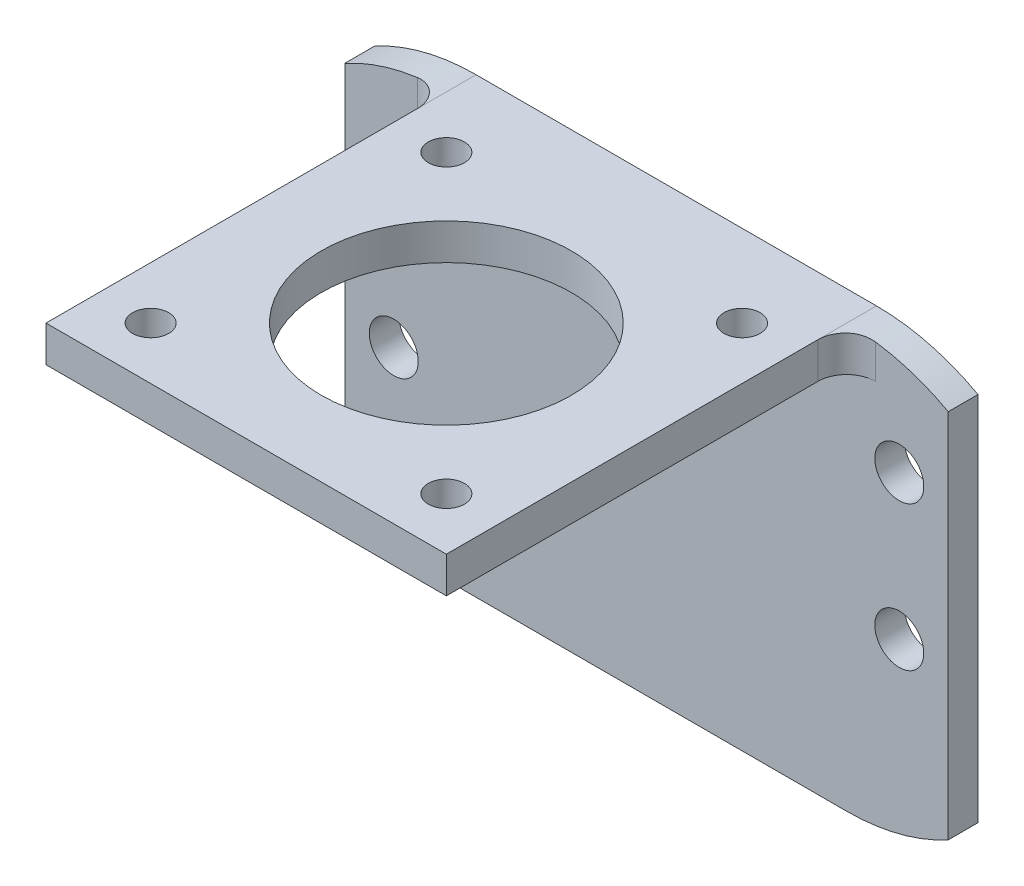
ISO-10303-21;
HEADER;
FILE_DESCRIPTION(('STEP AP214'),'2;1');
FILE_NAME('part.step','',(''),(''),'','','');
FILE_SCHEMA(('AUTOMOTIVE_DESIGN { 1 0 10303 214 1 1 1 1 }'));
ENDSEC;
DATA;
#1=APPLICATION_CONTEXT('core data for automotive mechanical design processes');
#2=APPLICATION_PROTOCOL_DEFINITION('international standard','automotive_design',2000,#1);
#3=PRODUCT_CONTEXT('',#1,'mechanical');
#4=PRODUCT('Part','Part','',(#3));
#5=PRODUCT_RELATED_PRODUCT_CATEGORY('part','',(#4));
#6=PRODUCT_DEFINITION_FORMATION('','',#4);
#7=PRODUCT_DEFINITION_CONTEXT('part definition',#1,'design');
#8=PRODUCT_DEFINITION('design','',#6,#7);
#9=PRODUCT_DEFINITION_SHAPE('','',#8);
#10=(LENGTH_UNIT() NAMED_UNIT(*) SI_UNIT(.MILLI.,.METRE.));
#11=(NAMED_UNIT(*) PLANE_ANGLE_UNIT() SI_UNIT($,.RADIAN.));
#12=(NAMED_UNIT(*) SI_UNIT($,.STERADIAN.) SOLID_ANGLE_UNIT());
#13=UNCERTAINTY_MEASURE_WITH_UNIT(LENGTH_MEASURE(1.E-05),#10,'distance_accuracy_value','');
#14=(GEOMETRIC_REPRESENTATION_CONTEXT(3) GLOBAL_UNCERTAINTY_ASSIGNED_CONTEXT((#13)) GLOBAL_UNIT_ASSIGNED_CONTEXT((#10,
#11,#12)) REPRESENTATION_CONTEXT('',''));
#15=CARTESIAN_POINT('',(0.,0.,0.));
#16=DIRECTION('',(0.,0.,1.));
#17=DIRECTION('',(1.,0.,0.));
#18=AXIS2_PLACEMENT_3D('',#15,#16,#17);
#19=CARTESIAN_POINT('',(-17.6,-34.000000072,-17.6));
#20=DIRECTION('',(0.,0.,1.));
#21=DIRECTION('',(1.,0.,0.));
#22=AXIS2_PLACEMENT_3D('',#19,#20,#21);
#23=PLANE('',#22);
#24=CARTESIAN_POINT('',(22.2228,-18.587500036,-17.6));
#25=DIRECTION('',(0.,0.,-1.));
#26=DIRECTION('',(-1.,0.,0.));
#27=AXIS2_PLACEMENT_3D('',#24,#25,#26);
#28=CIRCLE('',#27,2.15265);
#29=CARTESIAN_POINT('',(20.07015,-18.587500036,-17.6));
#30=VERTEX_POINT('',#29);
#31=EDGE_CURVE('E414',#30,#30,#28,.T.);
#32=ORIENTED_EDGE('',*,*,#31,.T.);
#33=EDGE_LOOP('',(#32));
#34=FACE_BOUND('',#33,.T.);
#35=CARTESIAN_POINT('',(22.2228,-5.887500036,-17.6));
#36=DIRECTION('',(0.,0.,-1.));
#37=DIRECTION('',(-1.,0.,0.));
#38=AXIS2_PLACEMENT_3D('',#35,#36,#37);
#39=CIRCLE('',#38,2.15265);
#40=CARTESIAN_POINT('',(20.07015,-5.887500036,-17.6));
#41=VERTEX_POINT('',#40);
#42=EDGE_CURVE('E395',#41,#41,#39,.T.);
#43=ORIENTED_EDGE('',*,*,#42,.T.);
#44=EDGE_LOOP('',(#43));
#45=FACE_BOUND('',#44,.T.);
#46=CARTESIAN_POINT('',(-22.2228,-18.587500036,-17.6));
#47=DIRECTION('',(0.,0.,1.));
#48=DIRECTION('',(1.,0.,0.));
#49=AXIS2_PLACEMENT_3D('',#46,#47,#48);
#50=CIRCLE('',#49,2.15265);
#51=CARTESIAN_POINT('',(-20.07015,-18.587500036,-17.6));
#52=VERTEX_POINT('',#51);
#53=EDGE_CURVE('E430',#52,#52,#50,.T.);
#54=ORIENTED_EDGE('',*,*,#53,.F.);
#55=EDGE_LOOP('',(#54));
#56=FACE_BOUND('',#55,.T.);
#57=CARTESIAN_POINT('',(-22.2228,-5.887500036,-17.6));
#58=DIRECTION('',(0.,0.,1.));
#59=DIRECTION('',(1.,0.,0.));
#60=AXIS2_PLACEMENT_3D('',#57,#58,#59);
#61=CIRCLE('',#60,2.15265);
#62=CARTESIAN_POINT('',(-20.07015,-5.887500036,-17.6));
#63=VERTEX_POINT('',#62);
#64=EDGE_CURVE('E423',#63,#63,#61,.T.);
#65=ORIENTED_EDGE('',*,*,#64,.F.);
#66=EDGE_LOOP('',(#65));
#67=FACE_BOUND('',#66,.T.);
#68=CARTESIAN_POINT('',(17.6,-15.412500036,-17.6));
#69=DIRECTION('',(0.,0.,-1.));
#70=DIRECTION('',(-1.,0.,0.));
#71=AXIS2_PLACEMENT_3D('',#68,#69,#70);
#72=CIRCLE('',#71,18.587500036);
#73=CARTESIAN_POINT('',(26.5281000000002,-31.7153889817758,-17.6));
#74=VERTEX_POINT('',#73);
#75=CARTESIAN_POINT('',(17.6,-34.000000072,-17.6));
#76=VERTEX_POINT('',#75);
#77=EDGE_CURVE('E164',#74,#76,#72,.T.);
#78=ORIENTED_EDGE('',*,*,#77,.F.);
#79=DIRECTION('',(0.,1.,0.));
#80=VECTOR('',#79,1.);
#81=CARTESIAN_POINT('',(26.5281000000002,-72.739111493604,-17.6));
#82=LINE('',#81,#80);
#83=CARTESIAN_POINT('',(26.5281000000002,0.890388909775759,-17.6));
#84=VERTEX_POINT('',#83);
#85=EDGE_CURVE('E55',#74,#84,#82,.T.);
#86=ORIENTED_EDGE('',*,*,#85,.T.);
#87=CARTESIAN_POINT('',(20.14,3.00063542725829,-17.6));
#88=VERTEX_POINT('',#87);
#89=EDGE_CURVE('E158',#88,#84,#72,.T.);
#90=ORIENTED_EDGE('',*,*,#89,.F.);
#91=DIRECTION('',(0.,1.,0.));
#92=VECTOR('',#91,1.);
#93=CARTESIAN_POINT('',(20.14,-34.000000072,-17.6));
#94=LINE('',#93,#92);
#95=CARTESIAN_POINT('',(20.14,0.,-17.6));
#96=VERTEX_POINT('',#95);
#97=EDGE_CURVE('E269',#88,#96,#94,.F.);
#98=ORIENTED_EDGE('',*,*,#97,.T.);
#99=DIRECTION('',(-1.,0.,0.));
#100=VECTOR('',#99,1.);
#101=CARTESIAN_POINT('',(-17.6,0.,-17.6));
#102=LINE('',#101,#100);
#103=CARTESIAN_POINT('',(-20.14,0.,-17.6));
#104=VERTEX_POINT('',#103);
#105=EDGE_CURVE('E254',#96,#104,#102,.T.);
#106=ORIENTED_EDGE('',*,*,#105,.T.);
#107=DIRECTION('',(0.,1.,0.));
#108=VECTOR('',#107,1.);
#109=CARTESIAN_POINT('',(-20.14,-34.000000072,-17.6));
#110=LINE('',#109,#108);
#111=CARTESIAN_POINT('',(-20.14,3.00063542725829,-17.6));
#112=VERTEX_POINT('',#111);
#113=EDGE_CURVE('E273',#104,#112,#110,.T.);
#114=ORIENTED_EDGE('',*,*,#113,.T.);
#115=CARTESIAN_POINT('',(-17.6,-15.412500036,-17.6));
#116=DIRECTION('',(0.,0.,1.));
#117=DIRECTION('',(1.,0.,0.));
#118=AXIS2_PLACEMENT_3D('',#115,#116,#117);
#119=CIRCLE('',#118,18.587500036);
#120=CARTESIAN_POINT('',(-26.5281000000002,0.890388909775761,-17.6));
#121=VERTEX_POINT('',#120);
#122=EDGE_CURVE('E172',#112,#121,#119,.T.);
#123=ORIENTED_EDGE('',*,*,#122,.T.);
#124=DIRECTION('',(0.,1.,0.));
#125=VECTOR('',#124,1.);
#126=CARTESIAN_POINT('',(-26.5281000000002,-72.739111493604,-17.6));
#127=LINE('',#126,#125);
#128=CARTESIAN_POINT('',(-26.5281000000002,-31.7153889817758,-17.6));
#129=VERTEX_POINT('',#128);
#130=EDGE_CURVE('E151',#129,#121,#127,.T.);
#131=ORIENTED_EDGE('',*,*,#130,.F.);
#132=CARTESIAN_POINT('',(-17.6,-34.000000072,-17.6));
#133=VERTEX_POINT('',#132);
#134=EDGE_CURVE('E162',#129,#133,#119,.T.);
#135=ORIENTED_EDGE('',*,*,#134,.T.);
#136=DIRECTION('',(1.,0.,0.));
#137=VECTOR('',#136,1.);
#138=CARTESIAN_POINT('',(-17.6,-34.000000072,-17.6));
#139=LINE('',#138,#137);
#140=EDGE_CURVE('E182',#133,#76,#139,.T.);
#141=ORIENTED_EDGE('',*,*,#140,.T.);
#142=EDGE_LOOP('',(#78,#86,#90,#98,#106,#114,#123,#131,#135,#141));
#143=FACE_BOUND('',#142,.T.);
#144=ADVANCED_FACE('F39',(#34,#45,#56,#67,#143),#23,.T.);
#145=CARTESIAN_POINT('',(-17.6,-34.000000072,-20.2162));
#146=DIRECTION('',(0.,0.,-1.));
#147=DIRECTION('',(-1.,0.,0.));
#148=AXIS2_PLACEMENT_3D('',#145,#146,#147);
#149=PLANE('',#148);
#150=CARTESIAN_POINT('',(22.2228,-18.587500036,-20.2162));
#151=DIRECTION('',(0.,0.,-1.));
#152=DIRECTION('',(-1.,0.,0.));
#153=AXIS2_PLACEMENT_3D('',#150,#151,#152);
#154=CIRCLE('',#153,2.15265);
#155=CARTESIAN_POINT('',(20.07015,-18.587500036,-20.2162));
#156=VERTEX_POINT('',#155);
#157=EDGE_CURVE('E418',#156,#156,#154,.T.);
#158=ORIENTED_EDGE('',*,*,#157,.F.);
#159=EDGE_LOOP('',(#158));
#160=FACE_BOUND('',#159,.T.);
#161=CARTESIAN_POINT('',(22.2228,-5.887500036,-20.2162));
#162=DIRECTION('',(0.,0.,-1.));
#163=DIRECTION('',(-1.,0.,0.));
#164=AXIS2_PLACEMENT_3D('',#161,#162,#163);
#165=CIRCLE('',#164,2.15265);
#166=CARTESIAN_POINT('',(20.07015,-5.887500036,-20.2162));
#167=VERTEX_POINT('',#166);
#168=EDGE_CURVE('E419',#167,#167,#165,.T.);
#169=ORIENTED_EDGE('',*,*,#168,.F.);
#170=EDGE_LOOP('',(#169));
#171=FACE_BOUND('',#170,.T.);
#172=CARTESIAN_POINT('',(-22.2228,-18.587500036,-20.2162));
#173=DIRECTION('',(0.,0.,-1.));
#174=DIRECTION('',(-1.,0.,0.));
#175=AXIS2_PLACEMENT_3D('',#172,#173,#174);
#176=CIRCLE('',#175,2.15265);
#177=CARTESIAN_POINT('',(-24.37545,-18.587500036,-20.2162));
#178=VERTEX_POINT('',#177);
#179=EDGE_CURVE('E171',#178,#178,#176,.F.);
#180=ORIENTED_EDGE('',*,*,#179,.T.);
#181=EDGE_LOOP('',(#180));
#182=FACE_BOUND('',#181,.T.);
#183=CARTESIAN_POINT('',(-22.2228,-5.887500036,-20.2162));
#184=DIRECTION('',(0.,0.,-1.));
#185=DIRECTION('',(-1.,0.,0.));
#186=AXIS2_PLACEMENT_3D('',#183,#184,#185);
#187=CIRCLE('',#186,2.15265);
#188=CARTESIAN_POINT('',(-24.37545,-5.887500036,-20.2162));
#189=VERTEX_POINT('',#188);
#190=EDGE_CURVE('E434',#189,#189,#187,.F.);
#191=ORIENTED_EDGE('',*,*,#190,.T.);
#192=EDGE_LOOP('',(#191));
#193=FACE_BOUND('',#192,.T.);
#194=CARTESIAN_POINT('',(17.6,-15.412500036,-20.2162));
#195=DIRECTION('',(0.,0.,-1.));
#196=DIRECTION('',(-1.,0.,0.));
#197=AXIS2_PLACEMENT_3D('',#194,#195,#196);
#198=CIRCLE('',#197,18.587500036);
#199=CARTESIAN_POINT('',(17.6,3.175,-20.2162));
#200=VERTEX_POINT('',#199);
#201=CARTESIAN_POINT('',(26.5281000000002,0.890388909775759,-20.2162));
#202=VERTEX_POINT('',#201);
#203=EDGE_CURVE('E149',#200,#202,#198,.T.);
#204=ORIENTED_EDGE('',*,*,#203,.T.);
#205=DIRECTION('',(0.,1.,0.));
#206=VECTOR('',#205,1.);
#207=CARTESIAN_POINT('',(26.5281000000002,-72.739111493604,-20.2162));
#208=LINE('',#207,#206);
#209=CARTESIAN_POINT('',(26.5281000000002,-31.7153889817758,-20.2162));
#210=VERTEX_POINT('',#209);
#211=EDGE_CURVE('E134',#210,#202,#208,.T.);
#212=ORIENTED_EDGE('',*,*,#211,.F.);
#213=CARTESIAN_POINT('',(17.6,-34.000000072,-20.2162));
#214=VERTEX_POINT('',#213);
#215=EDGE_CURVE('E145',#210,#214,#198,.T.);
#216=ORIENTED_EDGE('',*,*,#215,.T.);
#217=DIRECTION('',(-1.,0.,0.));
#218=VECTOR('',#217,1.);
#219=CARTESIAN_POINT('',(-17.6,-34.000000072,-20.2162));
#220=LINE('',#219,#218);
#221=CARTESIAN_POINT('',(-17.6,-34.000000072,-20.2162));
#222=VERTEX_POINT('',#221);
#223=EDGE_CURVE('E188',#214,#222,#220,.T.);
#224=ORIENTED_EDGE('',*,*,#223,.T.);
#225=CARTESIAN_POINT('',(-17.6,-15.412500036,-20.2162));
#226=DIRECTION('',(0.,0.,-1.));
#227=DIRECTION('',(-1.,0.,0.));
#228=AXIS2_PLACEMENT_3D('',#225,#226,#227);
#229=CIRCLE('',#228,18.587500036);
#230=CARTESIAN_POINT('',(-26.5281000000002,-31.7153889817758,-20.2162));
#231=VERTEX_POINT('',#230);
#232=EDGE_CURVE('E176',#231,#222,#229,.F.);
#233=ORIENTED_EDGE('',*,*,#232,.F.);
#234=DIRECTION('',(0.,1.,0.));
#235=VECTOR('',#234,1.);
#236=CARTESIAN_POINT('',(-26.5281000000002,-72.739111493604,-20.2162));
#237=LINE('',#236,#235);
#238=CARTESIAN_POINT('',(-26.5281000000002,0.890388909775761,-20.2162));
#239=VERTEX_POINT('',#238);
#240=EDGE_CURVE('E63',#231,#239,#237,.T.);
#241=ORIENTED_EDGE('',*,*,#240,.T.);
#242=CARTESIAN_POINT('',(-17.6,3.175,-20.2162));
#243=VERTEX_POINT('',#242);
#244=EDGE_CURVE('E177',#243,#239,#229,.F.);
#245=ORIENTED_EDGE('',*,*,#244,.F.);
#246=DIRECTION('',(-1.,0.,0.));
#247=VECTOR('',#246,1.);
#248=CARTESIAN_POINT('',(-17.6,3.175,-20.2162));
#249=LINE('',#248,#247);
#250=EDGE_CURVE('E181',#200,#243,#249,.T.);
#251=ORIENTED_EDGE('',*,*,#250,.F.);
#252=EDGE_LOOP('',(#204,#212,#216,#224,#233,#241,#245,#251));
#253=FACE_BOUND('',#252,.T.);
#254=ADVANCED_FACE('F143',(#160,#171,#182,#193,#253),#149,.T.);
#255=CARTESIAN_POINT('',(17.6,-15.412500036,-61.7791136122758));
#256=DIRECTION('',(0.,0.,1.));
#257=DIRECTION('',(1.,0.,0.));
#258=AXIS2_PLACEMENT_3D('',#255,#256,#257);
#259=CYLINDRICAL_SURFACE('',#258,18.587500036);
#260=DIRECTION('',(0.,0.,1.));
#261=VECTOR('',#260,1.);
#262=CARTESIAN_POINT('',(26.5281000000002,0.890388909775759,-61.7791136122758));
#263=LINE('',#262,#261);
#264=EDGE_CURVE('E11',#202,#84,#263,.T.);
#265=ORIENTED_EDGE('',*,*,#264,.F.);
#266=ORIENTED_EDGE('',*,*,#203,.F.);
#267=DIRECTION('',(0.,0.,1.));
#268=VECTOR('',#267,1.);
#269=CARTESIAN_POINT('',(17.6,3.175,-61.7791136122758));
#270=LINE('',#269,#268);
#271=CARTESIAN_POINT('',(17.6,3.175,-15.06));
#272=VERTEX_POINT('',#271);
#273=EDGE_CURVE('E168',#200,#272,#270,.T.);
#274=ORIENTED_EDGE('',*,*,#273,.T.);
#275=CARTESIAN_POINT('',(17.6,3.175,-15.06));
#276=CARTESIAN_POINT('',(17.5999931612362,3.17499693402641,-15.1314284172821));
#277=CARTESIAN_POINT('',(17.6030129793054,3.17499991997307,-15.2028535891198));
#278=CARTESIAN_POINT('',(17.6150530030966,3.17499569036358,-15.3451931400053));
#279=CARTESIAN_POINT('',(17.6240729257152,3.17498847528872,-15.4161075429933));
#280=CARTESIAN_POINT('',(17.6480515684337,3.17494155918318,-15.5568771701242));
#281=CARTESIAN_POINT('',(17.6630059890529,3.17490188164914,-15.6267331231476));
#282=CARTESIAN_POINT('',(17.698732316112,3.17474627704112,-15.7649200925291));
#283=CARTESIAN_POINT('',(17.7195041514546,3.17463035089897,-15.8332511275129));
#284=CARTESIAN_POINT('',(17.790378480981,3.17408607437965,-16.0352990115704));
#285=CARTESIAN_POINT('',(17.8490493592747,3.1734612891385,-16.1661264688547));
#286=CARTESIAN_POINT('',(17.9874767653926,3.17108887635561,-16.4159742418495));
#287=CARTESIAN_POINT('',(18.0672296398086,3.16934144328832,-16.5349965984169));
#288=CARTESIAN_POINT('',(18.2454940723609,3.16400177839637,-16.7578757419865));
#289=CARTESIAN_POINT('',(18.3439907594898,3.16041100523662,-16.8617444369928));
#290=CARTESIAN_POINT('',(18.5569498439056,3.15065537320439,-17.0514544234255));
#291=CARTESIAN_POINT('',(18.671414111685,3.1444902125912,-17.1372935998615));
#292=CARTESIAN_POINT('',(18.9125648468889,3.12899047816642,-17.288269162323));
#293=CARTESIAN_POINT('',(19.0392124257262,3.11966576391962,-17.3534687457287));
#294=CARTESIAN_POINT('',(19.3013252301638,3.09744066044685,-17.4617294221921));
#295=CARTESIAN_POINT('',(19.4367863982222,3.08454190782432,-17.5048006224497));
#296=CARTESIAN_POINT('',(19.6675262789357,3.05989129153794,-17.5574927622084));
#297=CARTESIAN_POINT('',(19.7615190081297,3.04913473893987,-17.573439843806));
#298=CARTESIAN_POINT('',(19.9503650862469,3.02604854916415,-17.5946929096138));
#299=CARTESIAN_POINT('',(20.0452169377388,3.01372128881368,-17.6000147733838));
#300=CARTESIAN_POINT('',(20.14,3.0006354272583,-17.6));
#301=B_SPLINE_CURVE_WITH_KNOTS('',3,(#275,#276,#277,#278,#279,#280,#281,#282,#283,#284,#285,
#286,#287,#288,#289,#290,#291,#292,#293,#294,#295,#296,#297,#298,#299,#300),.UNSPECIFIED.,.F.,
.F.,(4,2,2,2,2,2,2,2,2,2,2,2,4),(0.,0.21421558472874,0.42842106281944,0.642471633810544,
0.856519588907374,1.28444771401514,1.71230172980808,2.13981769847853,2.56738378983021,
2.99362774053708,3.41967682967415,3.706929625535,3.99375279512196),.UNSPECIFIED.);
#302=EDGE_CURVE('E369',#272,#88,#301,.T.);
#303=ORIENTED_EDGE('',*,*,#302,.T.);
#304=ORIENTED_EDGE('',*,*,#89,.T.);
#305=EDGE_LOOP('',(#265,#266,#274,#303,#304));
#306=FACE_BOUND('',#305,.T.);
#307=ADVANCED_FACE('F306',(#306),#259,.T.);
#308=DIRECTION('',(0.,0.,1.));
#309=VECTOR('',#308,1.);
#310=CARTESIAN_POINT('',(26.5281000000002,-31.7153889817758,-61.7791136122758));
#311=LINE('',#310,#309);
#312=EDGE_CURVE('E49',#74,#210,#311,.F.);
#313=ORIENTED_EDGE('',*,*,#312,.F.);
#314=ORIENTED_EDGE('',*,*,#77,.T.);
#315=DIRECTION('',(0.,0.,-1.));
#316=VECTOR('',#315,1.);
#317=CARTESIAN_POINT('',(17.6,-34.000000072,-17.6));
#318=LINE('',#317,#316);
#319=EDGE_CURVE('E156',#76,#214,#318,.T.);
#320=ORIENTED_EDGE('',*,*,#319,.T.);
#321=ORIENTED_EDGE('',*,*,#215,.F.);
#322=EDGE_LOOP('',(#313,#314,#320,#321));
#323=FACE_BOUND('',#322,.T.);
#324=ADVANCED_FACE('F154',(#323),#259,.T.);
#325=CARTESIAN_POINT('',(-17.6,-15.412500036,-61.7791136122758));
#326=DIRECTION('',(0.,0.,1.));
#327=DIRECTION('',(1.,0.,0.));
#328=AXIS2_PLACEMENT_3D('',#325,#326,#327);
#329=CYLINDRICAL_SURFACE('',#328,18.587500036);
#330=DIRECTION('',(0.,0.,1.));
#331=VECTOR('',#330,1.);
#332=CARTESIAN_POINT('',(-26.5281000000002,0.890388909775759,-61.7791136122758));
#333=LINE('',#332,#331);
#334=EDGE_CURVE('E140',#121,#239,#333,.F.);
#335=ORIENTED_EDGE('',*,*,#334,.F.);
#336=ORIENTED_EDGE('',*,*,#122,.F.);
#337=CARTESIAN_POINT('',(-20.14,3.00063542725829,-17.6));
#338=CARTESIAN_POINT('',(-20.0692924553346,3.01039313748778,-17.6000069827787));
#339=CARTESIAN_POINT('',(-19.9985286608016,3.01973573326216,-17.5970474692984));
#340=CARTESIAN_POINT('',(-19.857385702153,3.03755116012512,-17.5852199448435));
#341=CARTESIAN_POINT('',(-19.7870065428358,3.04602398038619,-17.5763518603256));
#342=CARTESIAN_POINT('',(-19.6471751542577,3.06205510170126,-17.5527390160558));
#343=CARTESIAN_POINT('',(-19.5777223770742,3.06961396680143,-17.5379979052133));
#344=CARTESIAN_POINT('',(-19.4402260368855,3.08381075540795,-17.502736368623));
#345=CARTESIAN_POINT('',(-19.372182429582,3.09044870790145,-17.482216124844));
#346=CARTESIAN_POINT('',(-19.1707978248236,3.10899687783809,-17.4121078935766));
#347=CARTESIAN_POINT('',(-19.0401888499217,3.1195430126498,-17.3539700057755));
#348=CARTESIAN_POINT('',(-18.7904916584162,3.13726041150881,-17.2165618740493));
#349=CARTESIAN_POINT('',(-18.6714003227553,3.14443259129124,-17.1372973733211));
#350=CARTESIAN_POINT('',(-18.4486411511082,3.15595044978954,-16.960272575627));
#351=CARTESIAN_POINT('',(-18.3449010064251,3.1603097274703,-16.8626042611015));
#352=CARTESIAN_POINT('',(-18.1551372943591,3.16695164969358,-16.651256306842));
#353=CARTESIAN_POINT('',(-18.0691178431168,3.1692338121862,-16.537572957458));
#354=CARTESIAN_POINT('',(-17.9170951586384,3.17245146158456,-16.2971633734574));
#355=CARTESIAN_POINT('',(-17.8511377634112,3.17338388257364,-16.1704081431069));
#356=CARTESIAN_POINT('',(-17.7413962589898,3.17454365914328,-15.9076681406179));
#357=CARTESIAN_POINT('',(-17.6976001795651,3.17477139569342,-15.7716883961275));
#358=CARTESIAN_POINT('',(-17.6437352753496,3.17496134322605,-15.5391425867541));
#359=CARTESIAN_POINT('',(-17.6273464137258,3.17498545833033,-15.4439913462555));
#360=CARTESIAN_POINT('',(-17.6054787825033,3.17500005264803,-15.2525730274839));
#361=CARTESIAN_POINT('',(-17.5999854130414,3.17499057692041,-15.1563076165195));
#362=CARTESIAN_POINT('',(-17.6,3.175,-15.06));
#363=B_SPLINE_CURVE_WITH_KNOTS('',3,(#337,#338,#339,#340,#341,#342,#343,#344,#345,#346,#347,
#348,#349,#350,#351,#352,#353,#354,#355,#356,#357,#358,#359,#360,#361,#362),.UNSPECIFIED.,.F.,
.F.,(4,2,2,2,2,2,2,2,2,2,2,2,4),(0.,0.214067809753982,0.428138284030593,0.642075963281206,
0.856006906983349,1.28382588921631,1.71152868874404,2.13714795400253,2.56286597037902,
2.98954948929682,3.41600229236707,3.70507439784128,3.99375888684438),.UNSPECIFIED.);
#364=CARTESIAN_POINT('',(-17.6,3.175,-15.06));
#365=VERTEX_POINT('',#364);
#366=EDGE_CURVE('E284',#112,#365,#363,.T.);
#367=ORIENTED_EDGE('',*,*,#366,.T.);
#368=DIRECTION('',(0.,0.,1.));
#369=VECTOR('',#368,1.);
#370=CARTESIAN_POINT('',(-17.6,3.175,17.6));
#371=LINE('',#370,#369);
#372=EDGE_CURVE('E244',#243,#365,#371,.T.);
#373=ORIENTED_EDGE('',*,*,#372,.F.);
#374=ORIENTED_EDGE('',*,*,#244,.T.);
#375=EDGE_LOOP('',(#335,#336,#367,#373,#374));
#376=FACE_BOUND('',#375,.T.);
#377=ADVANCED_FACE('F305',(#376),#329,.T.);
#378=CARTESIAN_POINT('',(0.,3.175,0.));
#379=DIRECTION('',(0.,-1.,0.));
#380=DIRECTION('',(0.,0.,-1.));
#381=AXIS2_PLACEMENT_3D('',#378,#379,#380);
#382=PLANE('',#381);
#383=DIRECTION('',(0.,0.,-1.));
#384=VECTOR('',#383,1.);
#385=CARTESIAN_POINT('',(17.6,3.175,17.6));
#386=LINE('',#385,#384);
#387=CARTESIAN_POINT('',(17.6,3.175,17.6));
#388=VERTEX_POINT('',#387);
#389=EDGE_CURVE('E238',#388,#272,#386,.T.);
#390=ORIENTED_EDGE('',*,*,#389,.T.);
#391=ORIENTED_EDGE('',*,*,#273,.F.);
#392=ORIENTED_EDGE('',*,*,#250,.T.);
#393=ORIENTED_EDGE('',*,*,#372,.T.);
#394=CARTESIAN_POINT('',(-17.6,3.175,17.6));
#395=VERTEX_POINT('',#394);
#396=EDGE_CURVE('E242',#365,#395,#371,.T.);
#397=ORIENTED_EDGE('',*,*,#396,.T.);
#398=DIRECTION('',(1.,0.,0.));
#399=VECTOR('',#398,1.);
#400=CARTESIAN_POINT('',(-17.6,3.175,17.6));
#401=LINE('',#400,#399);
#402=EDGE_CURVE('E247',#395,#388,#401,.T.);
#403=ORIENTED_EDGE('',*,*,#402,.T.);
#404=EDGE_LOOP('',(#390,#391,#392,#393,#397,#403));
#405=FACE_BOUND('',#404,.T.);
#406=CARTESIAN_POINT('',(13.,3.175,-13.));
#407=DIRECTION('',(0.,1.,0.));
#408=DIRECTION('',(0.,0.,1.));
#409=AXIS2_PLACEMENT_3D('',#406,#407,#408);
#410=CIRCLE('',#409,1.5875);
#411=CARTESIAN_POINT('',(13.,3.175,-11.4125));
#412=VERTEX_POINT('',#411);
#413=EDGE_CURVE('E230',#412,#412,#410,.T.);
#414=ORIENTED_EDGE('',*,*,#413,.F.);
#415=EDGE_LOOP('',(#414));
#416=FACE_BOUND('',#415,.T.);
#417=CARTESIAN_POINT('',(-13.,3.175,-13.));
#418=DIRECTION('',(0.,1.,0.));
#419=DIRECTION('',(0.,0.,-1.));
#420=AXIS2_PLACEMENT_3D('',#417,#418,#419);
#421=CIRCLE('',#420,1.5875);
#422=CARTESIAN_POINT('',(-13.,3.175,-14.5875));
#423=VERTEX_POINT('',#422);
#424=EDGE_CURVE('E222',#423,#423,#421,.T.);
#425=ORIENTED_EDGE('',*,*,#424,.F.);
#426=EDGE_LOOP('',(#425));
#427=FACE_BOUND('',#426,.T.);
#428=CARTESIAN_POINT('',(13.,3.175,13.));
#429=DIRECTION('',(0.,1.,0.));
#430=DIRECTION('',(0.,0.,-1.));
#431=AXIS2_PLACEMENT_3D('',#428,#429,#430);
#432=CIRCLE('',#431,1.5875);
#433=CARTESIAN_POINT('',(13.,3.175,11.4125));
#434=VERTEX_POINT('',#433);
#435=EDGE_CURVE('E214',#434,#434,#432,.T.);
#436=ORIENTED_EDGE('',*,*,#435,.F.);
#437=EDGE_LOOP('',(#436));
#438=FACE_BOUND('',#437,.T.);
#439=CARTESIAN_POINT('',(-13.,3.175,13.));
#440=DIRECTION('',(0.,1.,0.));
#441=DIRECTION('',(0.,0.,1.));
#442=AXIS2_PLACEMENT_3D('',#439,#440,#441);
#443=CIRCLE('',#442,1.5875);
#444=CARTESIAN_POINT('',(-13.,3.175,14.5875));
#445=VERTEX_POINT('',#444);
#446=EDGE_CURVE('E206',#445,#445,#443,.T.);
#447=ORIENTED_EDGE('',*,*,#446,.F.);
#448=EDGE_LOOP('',(#447));
#449=FACE_BOUND('',#448,.T.);
#450=CARTESIAN_POINT('',(0.,3.175,0.));
#451=DIRECTION('',(0.,1.,0.));
#452=DIRECTION('',(0.,0.,1.));
#453=AXIS2_PLACEMENT_3D('',#450,#451,#452);
#454=CIRCLE('',#453,11.);
#455=CARTESIAN_POINT('',(0.,3.175,11.));
#456=VERTEX_POINT('',#455);
#457=EDGE_CURVE('E198',#456,#456,#454,.T.);
#458=ORIENTED_EDGE('',*,*,#457,.F.);
#459=EDGE_LOOP('',(#458));
#460=FACE_BOUND('',#459,.T.);
#461=ADVANCED_FACE('F339',(#405,#416,#427,#438,#449,#460),#382,.F.);
#462=CARTESIAN_POINT('',(0.,0.,0.));
#463=DIRECTION('',(0.,-1.,0.));
#464=DIRECTION('',(0.,0.,-1.));
#465=AXIS2_PLACEMENT_3D('',#462,#463,#464);
#466=PLANE('',#465);
#467=CARTESIAN_POINT('',(-13.,0.,13.));
#468=DIRECTION('',(0.,1.,0.));
#469=DIRECTION('',(0.,0.,1.));
#470=AXIS2_PLACEMENT_3D('',#467,#468,#469);
#471=CIRCLE('',#470,1.5875);
#472=CARTESIAN_POINT('',(-13.,0.,14.5875));
#473=VERTEX_POINT('',#472);
#474=EDGE_CURVE('E202',#473,#473,#471,.T.);
#475=ORIENTED_EDGE('',*,*,#474,.T.);
#476=EDGE_LOOP('',(#475));
#477=FACE_BOUND('',#476,.T.);
#478=CARTESIAN_POINT('',(-13.,0.,-13.));
#479=DIRECTION('',(0.,1.,0.));
#480=DIRECTION('',(0.,0.,-1.));
#481=AXIS2_PLACEMENT_3D('',#478,#479,#480);
#482=CIRCLE('',#481,1.5875);
#483=CARTESIAN_POINT('',(-13.,0.,-14.5875));
#484=VERTEX_POINT('',#483);
#485=EDGE_CURVE('E218',#484,#484,#482,.T.);
#486=ORIENTED_EDGE('',*,*,#485,.T.);
#487=EDGE_LOOP('',(#486));
#488=FACE_BOUND('',#487,.T.);
#489=DIRECTION('',(0.,0.,-1.));
#490=VECTOR('',#489,1.);
#491=CARTESIAN_POINT('',(17.6,0.,17.6));
#492=LINE('',#491,#490);
#493=CARTESIAN_POINT('',(17.6,0.,17.6));
#494=VERTEX_POINT('',#493);
#495=CARTESIAN_POINT('',(17.6,0.,-15.06));
#496=VERTEX_POINT('',#495);
#497=EDGE_CURVE('E234',#494,#496,#492,.T.);
#498=ORIENTED_EDGE('',*,*,#497,.F.);
#499=DIRECTION('',(1.,0.,0.));
#500=VECTOR('',#499,1.);
#501=CARTESIAN_POINT('',(-17.6,0.,17.6));
#502=LINE('',#501,#500);
#503=CARTESIAN_POINT('',(-17.6,0.,17.6));
#504=VERTEX_POINT('',#503);
#505=EDGE_CURVE('E243',#504,#494,#502,.T.);
#506=ORIENTED_EDGE('',*,*,#505,.F.);
#507=DIRECTION('',(0.,0.,1.));
#508=VECTOR('',#507,1.);
#509=CARTESIAN_POINT('',(-17.6,0.,17.6));
#510=LINE('',#509,#508);
#511=CARTESIAN_POINT('',(-17.6,0.,-15.06));
#512=VERTEX_POINT('',#511);
#513=EDGE_CURVE('E257',#512,#504,#510,.T.);
#514=ORIENTED_EDGE('',*,*,#513,.F.);
#515=CARTESIAN_POINT('',(-20.14,0.,-15.06));
#516=DIRECTION('',(0.,-1.,0.));
#517=DIRECTION('',(0.,0.,-1.));
#518=AXIS2_PLACEMENT_3D('',#515,#516,#517);
#519=CIRCLE('',#518,2.54);
#520=EDGE_CURVE('E293',#512,#104,#519,.F.);
#521=ORIENTED_EDGE('',*,*,#520,.T.);
#522=ORIENTED_EDGE('',*,*,#105,.F.);
#523=CARTESIAN_POINT('',(20.14,0.,-15.06));
#524=DIRECTION('',(0.,-1.,0.));
#525=DIRECTION('',(0.,0.,-1.));
#526=AXIS2_PLACEMENT_3D('',#523,#524,#525);
#527=CIRCLE('',#526,2.54);
#528=EDGE_CURVE('E368',#96,#496,#527,.F.);
#529=ORIENTED_EDGE('',*,*,#528,.T.);
#530=EDGE_LOOP('',(#498,#506,#514,#521,#522,#529));
#531=FACE_BOUND('',#530,.T.);
#532=CARTESIAN_POINT('',(13.,0.,-13.));
#533=DIRECTION('',(0.,1.,0.));
#534=DIRECTION('',(0.,0.,1.));
#535=AXIS2_PLACEMENT_3D('',#532,#533,#534);
#536=CIRCLE('',#535,1.5875);
#537=CARTESIAN_POINT('',(13.,0.,-11.4125));
#538=VERTEX_POINT('',#537);
#539=EDGE_CURVE('E226',#538,#538,#536,.T.);
#540=ORIENTED_EDGE('',*,*,#539,.T.);
#541=EDGE_LOOP('',(#540));
#542=FACE_BOUND('',#541,.T.);
#543=CARTESIAN_POINT('',(13.,0.,13.));
#544=DIRECTION('',(0.,1.,0.));
#545=DIRECTION('',(0.,0.,-1.));
#546=AXIS2_PLACEMENT_3D('',#543,#544,#545);
#547=CIRCLE('',#546,1.5875);
#548=CARTESIAN_POINT('',(13.,0.,11.4125));
#549=VERTEX_POINT('',#548);
#550=EDGE_CURVE('E210',#549,#549,#547,.T.);
#551=ORIENTED_EDGE('',*,*,#550,.T.);
#552=EDGE_LOOP('',(#551));
#553=FACE_BOUND('',#552,.T.);
#554=CARTESIAN_POINT('',(0.,0.,0.));
#555=DIRECTION('',(0.,1.,0.));
#556=DIRECTION('',(0.,0.,1.));
#557=AXIS2_PLACEMENT_3D('',#554,#555,#556);
#558=CIRCLE('',#557,11.);
#559=CARTESIAN_POINT('',(0.,0.,11.));
#560=VERTEX_POINT('',#559);
#561=EDGE_CURVE('E195',#560,#560,#558,.T.);
#562=ORIENTED_EDGE('',*,*,#561,.T.);
#563=EDGE_LOOP('',(#562));
#564=FACE_BOUND('',#563,.T.);
#565=ADVANCED_FACE('F342',(#477,#488,#531,#542,#553,#564),#466,.T.);
#566=CARTESIAN_POINT('',(17.6,3.175,17.6));
#567=DIRECTION('',(-1.,0.,0.));
#568=DIRECTION('',(0.,0.,1.));
#569=AXIS2_PLACEMENT_3D('',#566,#567,#568);
#570=PLANE('',#569);
#571=ORIENTED_EDGE('',*,*,#497,.T.);
#572=DIRECTION('',(0.,1.,0.));
#573=VECTOR('',#572,1.);
#574=CARTESIAN_POINT('',(17.6,3.175,-15.06));
#575=LINE('',#574,#573);
#576=EDGE_CURVE('E280',#496,#272,#575,.T.);
#577=ORIENTED_EDGE('',*,*,#576,.T.);
#578=ORIENTED_EDGE('',*,*,#389,.F.);
#579=DIRECTION('',(0.,-1.,0.));
#580=VECTOR('',#579,1.);
#581=CARTESIAN_POINT('',(17.6,3.175,17.6));
#582=LINE('',#581,#580);
#583=EDGE_CURVE('E250',#388,#494,#582,.T.);
#584=ORIENTED_EDGE('',*,*,#583,.T.);
#585=EDGE_LOOP('',(#571,#577,#578,#584));
#586=FACE_BOUND('',#585,.T.);
#587=ADVANCED_FACE('F346',(#586),#570,.F.);
#588=CARTESIAN_POINT('',(-17.6,3.175,17.6));
#589=DIRECTION('',(1.,0.,0.));
#590=DIRECTION('',(0.,0.,-1.));
#591=AXIS2_PLACEMENT_3D('',#588,#589,#590);
#592=PLANE('',#591);
#593=ORIENTED_EDGE('',*,*,#396,.F.);
#594=DIRECTION('',(0.,1.,0.));
#595=VECTOR('',#594,1.);
#596=CARTESIAN_POINT('',(-17.6,3.175,-15.06));
#597=LINE('',#596,#595);
#598=EDGE_CURVE('E277',#365,#512,#597,.F.);
#599=ORIENTED_EDGE('',*,*,#598,.T.);
#600=ORIENTED_EDGE('',*,*,#513,.T.);
#601=DIRECTION('',(0.,-1.,0.));
#602=VECTOR('',#601,1.);
#603=CARTESIAN_POINT('',(-17.6,3.175,17.6));
#604=LINE('',#603,#602);
#605=EDGE_CURVE('E265',#395,#504,#604,.T.);
#606=ORIENTED_EDGE('',*,*,#605,.F.);
#607=EDGE_LOOP('',(#593,#599,#600,#606));
#608=FACE_BOUND('',#607,.T.);
#609=ADVANCED_FACE('F350',(#608),#592,.F.);
#610=CARTESIAN_POINT('',(-17.6,3.175,17.6));
#611=DIRECTION('',(0.,0.,-1.));
#612=DIRECTION('',(-1.,0.,0.));
#613=AXIS2_PLACEMENT_3D('',#610,#611,#612);
#614=PLANE('',#613);
#615=ORIENTED_EDGE('',*,*,#505,.T.);
#616=ORIENTED_EDGE('',*,*,#583,.F.);
#617=ORIENTED_EDGE('',*,*,#402,.F.);
#618=ORIENTED_EDGE('',*,*,#605,.T.);
#619=EDGE_LOOP('',(#615,#616,#617,#618));
#620=FACE_BOUND('',#619,.T.);
#621=ADVANCED_FACE('F337',(#620),#614,.F.);
#622=CARTESIAN_POINT('',(13.,3.175,-13.));
#623=DIRECTION('',(0.,-1.,0.));
#624=DIRECTION('',(0.,0.,-1.));
#625=AXIS2_PLACEMENT_3D('',#622,#623,#624);
#626=CYLINDRICAL_SURFACE('',#625,1.5875);
#627=ORIENTED_EDGE('',*,*,#413,.T.);
#628=EDGE_LOOP('',(#627));
#629=FACE_BOUND('',#628,.T.);
#630=ORIENTED_EDGE('',*,*,#539,.F.);
#631=EDGE_LOOP('',(#630));
#632=FACE_BOUND('',#631,.T.);
#633=ADVANCED_FACE('F333',(#629,#632),#626,.F.);
#634=CARTESIAN_POINT('',(-13.,3.175,-13.));
#635=DIRECTION('',(0.,-1.,0.));
#636=DIRECTION('',(0.,0.,-1.));
#637=AXIS2_PLACEMENT_3D('',#634,#635,#636);
#638=CYLINDRICAL_SURFACE('',#637,1.5875);
#639=ORIENTED_EDGE('',*,*,#424,.T.);
#640=EDGE_LOOP('',(#639));
#641=FACE_BOUND('',#640,.T.);
#642=ORIENTED_EDGE('',*,*,#485,.F.);
#643=EDGE_LOOP('',(#642));
#644=FACE_BOUND('',#643,.T.);
#645=ADVANCED_FACE('F329',(#641,#644),#638,.F.);
#646=CARTESIAN_POINT('',(13.,3.175,13.));
#647=DIRECTION('',(0.,-1.,0.));
#648=DIRECTION('',(0.,0.,-1.));
#649=AXIS2_PLACEMENT_3D('',#646,#647,#648);
#650=CYLINDRICAL_SURFACE('',#649,1.5875);
#651=ORIENTED_EDGE('',*,*,#435,.T.);
#652=EDGE_LOOP('',(#651));
#653=FACE_BOUND('',#652,.T.);
#654=ORIENTED_EDGE('',*,*,#550,.F.);
#655=EDGE_LOOP('',(#654));
#656=FACE_BOUND('',#655,.T.);
#657=ADVANCED_FACE('F325',(#653,#656),#650,.F.);
#658=CARTESIAN_POINT('',(-13.,3.175,13.));
#659=DIRECTION('',(0.,-1.,0.));
#660=DIRECTION('',(0.,0.,-1.));
#661=AXIS2_PLACEMENT_3D('',#658,#659,#660);
#662=CYLINDRICAL_SURFACE('',#661,1.5875);
#663=ORIENTED_EDGE('',*,*,#446,.T.);
#664=EDGE_LOOP('',(#663));
#665=FACE_BOUND('',#664,.T.);
#666=ORIENTED_EDGE('',*,*,#474,.F.);
#667=EDGE_LOOP('',(#666));
#668=FACE_BOUND('',#667,.T.);
#669=ADVANCED_FACE('F321',(#665,#668),#662,.F.);
#670=CARTESIAN_POINT('',(0.,3.175,0.));
#671=DIRECTION('',(0.,-1.,0.));
#672=DIRECTION('',(0.,0.,-1.));
#673=AXIS2_PLACEMENT_3D('',#670,#671,#672);
#674=CYLINDRICAL_SURFACE('',#673,11.);
#675=ORIENTED_EDGE('',*,*,#457,.T.);
#676=EDGE_LOOP('',(#675));
#677=FACE_BOUND('',#676,.T.);
#678=ORIENTED_EDGE('',*,*,#561,.F.);
#679=EDGE_LOOP('',(#678));
#680=FACE_BOUND('',#679,.T.);
#681=ADVANCED_FACE('F311',(#677,#680),#674,.F.);
#682=CARTESIAN_POINT('',(0.,-34.000000072,0.));
#683=DIRECTION('',(0.,1.,0.));
#684=DIRECTION('',(0.,0.,1.));
#685=AXIS2_PLACEMENT_3D('',#682,#683,#684);
#686=PLANE('',#685);
#687=ORIENTED_EDGE('',*,*,#140,.F.);
#688=DIRECTION('',(0.,0.,1.));
#689=VECTOR('',#688,1.);
#690=CARTESIAN_POINT('',(-17.6,-34.000000072,-17.6));
#691=LINE('',#690,#689);
#692=EDGE_CURVE('E191',#222,#133,#691,.T.);
#693=ORIENTED_EDGE('',*,*,#692,.F.);
#694=ORIENTED_EDGE('',*,*,#223,.F.);
#695=ORIENTED_EDGE('',*,*,#319,.F.);
#696=EDGE_LOOP('',(#687,#693,#694,#695));
#697=FACE_BOUND('',#696,.T.);
#698=ADVANCED_FACE('F303',(#697),#686,.F.);
#699=DIRECTION('',(0.,0.,1.));
#700=VECTOR('',#699,1.);
#701=CARTESIAN_POINT('',(-26.5281000000002,-31.7153889817758,-61.7791136122758));
#702=LINE('',#701,#700);
#703=EDGE_CURVE('E375',#231,#129,#702,.T.);
#704=ORIENTED_EDGE('',*,*,#703,.F.);
#705=ORIENTED_EDGE('',*,*,#232,.T.);
#706=ORIENTED_EDGE('',*,*,#692,.T.);
#707=ORIENTED_EDGE('',*,*,#134,.F.);
#708=EDGE_LOOP('',(#704,#705,#706,#707));
#709=FACE_BOUND('',#708,.T.);
#710=ADVANCED_FACE('F298',(#709),#329,.T.);
#711=CARTESIAN_POINT('',(-20.14,-34.000000072,-15.06));
#712=DIRECTION('',(0.,1.,0.));
#713=DIRECTION('',(0.,0.,1.));
#714=AXIS2_PLACEMENT_3D('',#711,#712,#713);
#715=CYLINDRICAL_SURFACE('',#714,2.54);
#716=ORIENTED_EDGE('',*,*,#520,.F.);
#717=ORIENTED_EDGE('',*,*,#598,.F.);
#718=ORIENTED_EDGE('',*,*,#366,.F.);
#719=ORIENTED_EDGE('',*,*,#113,.F.);
#720=EDGE_LOOP('',(#716,#717,#718,#719));
#721=FACE_BOUND('',#720,.T.);
#722=ADVANCED_FACE('F295',(#721),#715,.F.);
#723=CARTESIAN_POINT('',(20.14,3.175,-15.06));
#724=DIRECTION('',(0.,1.,0.));
#725=DIRECTION('',(0.,0.,1.));
#726=AXIS2_PLACEMENT_3D('',#723,#724,#725);
#727=CYLINDRICAL_SURFACE('',#726,2.54);
#728=ORIENTED_EDGE('',*,*,#528,.F.);
#729=ORIENTED_EDGE('',*,*,#97,.F.);
#730=ORIENTED_EDGE('',*,*,#302,.F.);
#731=ORIENTED_EDGE('',*,*,#576,.F.);
#732=EDGE_LOOP('',(#728,#729,#730,#731));
#733=FACE_BOUND('',#732,.T.);
#734=ADVANCED_FACE('F41',(#733),#727,.F.);
#735=CARTESIAN_POINT('',(-22.2228,-5.887500036,-26.3048136500849));
#736=DIRECTION('',(0.,0.,1.));
#737=DIRECTION('',(1.,0.,0.));
#738=AXIS2_PLACEMENT_3D('',#735,#736,#737);
#739=CYLINDRICAL_SURFACE('',#738,2.15265);
#740=ORIENTED_EDGE('',*,*,#64,.T.);
#741=EDGE_LOOP('',(#740));
#742=FACE_BOUND('',#741,.T.);
#743=ORIENTED_EDGE('',*,*,#190,.F.);
#744=EDGE_LOOP('',(#743));
#745=FACE_BOUND('',#744,.T.);
#746=ADVANCED_FACE('F445',(#742,#745),#739,.F.);
#747=CARTESIAN_POINT('',(-22.2228,-18.587500036,-26.3048136500849));
#748=DIRECTION('',(0.,0.,1.));
#749=DIRECTION('',(1.,0.,0.));
#750=AXIS2_PLACEMENT_3D('',#747,#748,#749);
#751=CYLINDRICAL_SURFACE('',#750,2.15265);
#752=ORIENTED_EDGE('',*,*,#53,.T.);
#753=EDGE_LOOP('',(#752));
#754=FACE_BOUND('',#753,.T.);
#755=ORIENTED_EDGE('',*,*,#179,.F.);
#756=EDGE_LOOP('',(#755));
#757=FACE_BOUND('',#756,.T.);
#758=ADVANCED_FACE('F447',(#754,#757),#751,.F.);
#759=CARTESIAN_POINT('',(22.2228,-5.887500036,-26.3048136500849));
#760=DIRECTION('',(0.,0.,1.));
#761=DIRECTION('',(1.,0.,0.));
#762=AXIS2_PLACEMENT_3D('',#759,#760,#761);
#763=CYLINDRICAL_SURFACE('',#762,2.15265);
#764=ORIENTED_EDGE('',*,*,#42,.F.);
#765=EDGE_LOOP('',(#764));
#766=FACE_BOUND('',#765,.T.);
#767=ORIENTED_EDGE('',*,*,#168,.T.);
#768=EDGE_LOOP('',(#767));
#769=FACE_BOUND('',#768,.T.);
#770=ADVANCED_FACE('F453',(#766,#769),#763,.F.);
#771=CARTESIAN_POINT('',(22.2228,-18.587500036,-26.3048136500849));
#772=DIRECTION('',(0.,0.,1.));
#773=DIRECTION('',(1.,0.,0.));
#774=AXIS2_PLACEMENT_3D('',#771,#772,#773);
#775=CYLINDRICAL_SURFACE('',#774,2.15265);
#776=ORIENTED_EDGE('',*,*,#31,.F.);
#777=EDGE_LOOP('',(#776));
#778=FACE_BOUND('',#777,.T.);
#779=ORIENTED_EDGE('',*,*,#157,.T.);
#780=EDGE_LOOP('',(#779));
#781=FACE_BOUND('',#780,.T.);
#782=ADVANCED_FACE('F459',(#778,#781),#775,.F.);
#783=CARTESIAN_POINT('',(-26.5281000000002,-72.739111493604,-97.6660337290006));
#784=DIRECTION('',(1.,0.,0.));
#785=DIRECTION('',(0.,0.,-1.));
#786=AXIS2_PLACEMENT_3D('',#783,#784,#785);
#787=PLANE('',#786);
#788=ORIENTED_EDGE('',*,*,#334,.T.);
#789=ORIENTED_EDGE('',*,*,#240,.F.);
#790=ORIENTED_EDGE('',*,*,#703,.T.);
#791=ORIENTED_EDGE('',*,*,#130,.T.);
#792=EDGE_LOOP('',(#788,#789,#790,#791));
#793=FACE_BOUND('',#792,.T.);
#794=ADVANCED_FACE('F387',(#793),#787,.F.);
#795=CARTESIAN_POINT('',(26.5281000000002,-72.739111493604,-97.6660337290006));
#796=DIRECTION('',(1.,0.,0.));
#797=DIRECTION('',(0.,0.,-1.));
#798=AXIS2_PLACEMENT_3D('',#795,#796,#797);
#799=PLANE('',#798);
#800=ORIENTED_EDGE('',*,*,#264,.T.);
#801=ORIENTED_EDGE('',*,*,#85,.F.);
#802=ORIENTED_EDGE('',*,*,#312,.T.);
#803=ORIENTED_EDGE('',*,*,#211,.T.);
#804=EDGE_LOOP('',(#800,#801,#802,#803));
#805=FACE_BOUND('',#804,.T.);
#806=ADVANCED_FACE('F133',(#805),#799,.T.);
#807=CLOSED_SHELL('',(#144,#254,#307,#324,#377,#461,#565,#587,#609,#621,#633,#645,#657,#669,
#681,#698,#710,#722,#734,#746,#758,#770,#782,#794,#806));
#808=MANIFOLD_SOLID_BREP('B2',#807);
#809=ADVANCED_BREP_SHAPE_REPRESENTATION('',(#18,#808),#14);
#810=SHAPE_DEFINITION_REPRESENTATION(#9,#809);
ENDSEC;
END-ISO-10303-21;
